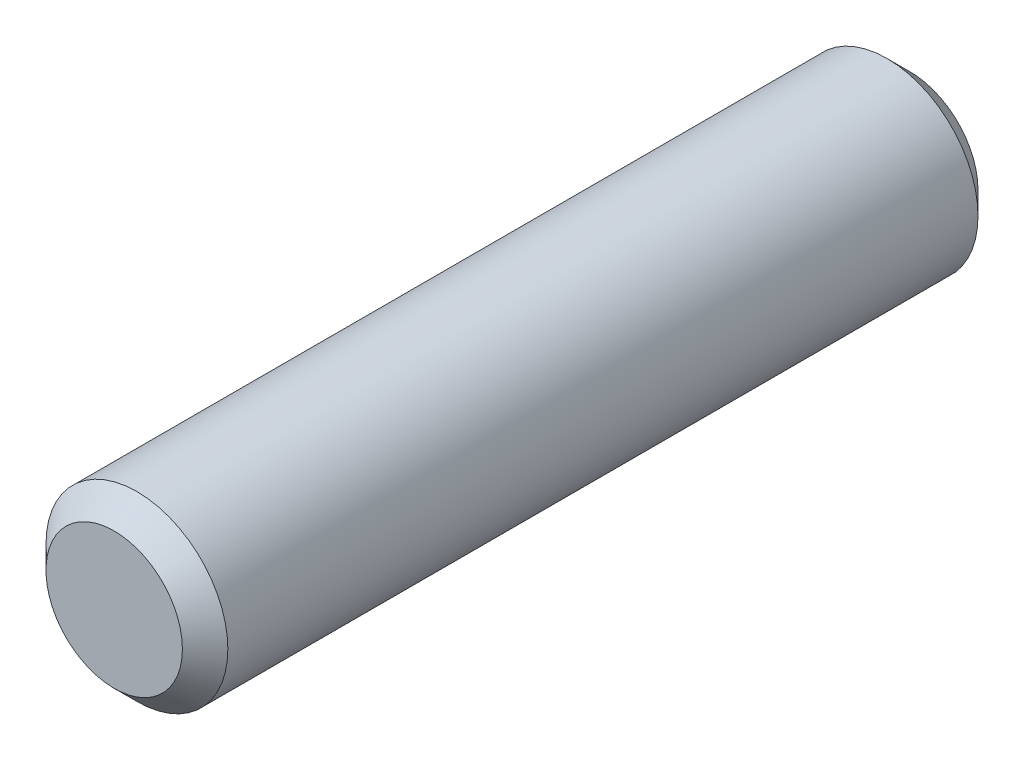
ISO-10303-21;
HEADER;
FILE_DESCRIPTION(('STEP AP214'),'2;1');
FILE_NAME('part.step','',(''),(''),'','','');
FILE_SCHEMA(('AUTOMOTIVE_DESIGN { 1 0 10303 214 1 1 1 1 }'));
ENDSEC;
DATA;
#1=APPLICATION_CONTEXT('core data for automotive mechanical design processes');
#2=APPLICATION_PROTOCOL_DEFINITION('international standard','automotive_design',2000,#1);
#3=PRODUCT_CONTEXT('',#1,'mechanical');
#4=PRODUCT('Part','Part','',(#3));
#5=PRODUCT_RELATED_PRODUCT_CATEGORY('part','',(#4));
#6=PRODUCT_DEFINITION_FORMATION('','',#4);
#7=PRODUCT_DEFINITION_CONTEXT('part definition',#1,'design');
#8=PRODUCT_DEFINITION('design','',#6,#7);
#9=PRODUCT_DEFINITION_SHAPE('','',#8);
#10=(LENGTH_UNIT() NAMED_UNIT(*) SI_UNIT(.MILLI.,.METRE.));
#11=(NAMED_UNIT(*) PLANE_ANGLE_UNIT() SI_UNIT($,.RADIAN.));
#12=(NAMED_UNIT(*) SI_UNIT($,.STERADIAN.) SOLID_ANGLE_UNIT());
#13=UNCERTAINTY_MEASURE_WITH_UNIT(LENGTH_MEASURE(1.E-05),#10,'distance_accuracy_value','');
#14=(GEOMETRIC_REPRESENTATION_CONTEXT(3) GLOBAL_UNCERTAINTY_ASSIGNED_CONTEXT((#13)) GLOBAL_UNIT_ASSIGNED_CONTEXT((#10,
#11,#12)) REPRESENTATION_CONTEXT('',''));
#15=CARTESIAN_POINT('',(0.,0.,0.));
#16=DIRECTION('',(0.,0.,1.));
#17=DIRECTION('',(1.,0.,0.));
#18=AXIS2_PLACEMENT_3D('',#15,#16,#17);
#19=CARTESIAN_POINT('',(0.,0.,35.));
#20=DIRECTION('',(0.,0.,-1.));
#21=DIRECTION('',(-1.,0.,0.));
#22=AXIS2_PLACEMENT_3D('',#19,#20,#21);
#23=CYLINDRICAL_SURFACE('',#22,4.);
#24=CARTESIAN_POINT('',(0.,0.,34.));
#25=DIRECTION('',(0.,0.,1.));
#26=DIRECTION('',(1.,0.,0.));
#27=AXIS2_PLACEMENT_3D('',#24,#25,#26);
#28=CIRCLE('',#27,4.);
#29=CARTESIAN_POINT('',(4.,0.,34.));
#30=VERTEX_POINT('',#29);
#31=EDGE_CURVE('E37',#30,#30,#28,.F.);
#32=ORIENTED_EDGE('',*,*,#31,.T.);
#33=EDGE_LOOP('',(#32));
#34=FACE_BOUND('',#33,.T.);
#35=CARTESIAN_POINT('',(0.,0.,1.00000000000001));
#36=DIRECTION('',(0.,0.,1.));
#37=DIRECTION('',(1.,0.,0.));
#38=AXIS2_PLACEMENT_3D('',#35,#36,#37);
#39=CIRCLE('',#38,4.);
#40=CARTESIAN_POINT('',(4.,0.,1.00000000000001));
#41=VERTEX_POINT('',#40);
#42=EDGE_CURVE('E41',#41,#41,#39,.T.);
#43=ORIENTED_EDGE('',*,*,#42,.T.);
#44=EDGE_LOOP('',(#43));
#45=FACE_BOUND('',#44,.T.);
#46=ADVANCED_FACE('F31',(#34,#45),#23,.T.);
#47=CARTESIAN_POINT('',(0.,0.,35.));
#48=DIRECTION('',(0.,0.,1.));
#49=DIRECTION('',(1.,0.,0.));
#50=AXIS2_PLACEMENT_3D('',#47,#48,#49);
#51=PLANE('',#50);
#52=CARTESIAN_POINT('',(0.,0.,35.));
#53=DIRECTION('',(0.,0.,1.));
#54=DIRECTION('',(1.,0.,0.));
#55=AXIS2_PLACEMENT_3D('',#52,#53,#54);
#56=CIRCLE('',#55,2.99999999999998);
#57=CARTESIAN_POINT('',(2.99999999999998,0.,35.));
#58=VERTEX_POINT('',#57);
#59=EDGE_CURVE('E45',#58,#58,#56,.T.);
#60=ORIENTED_EDGE('',*,*,#59,.T.);
#61=EDGE_LOOP('',(#60));
#62=FACE_BOUND('',#61,.T.);
#63=ADVANCED_FACE('F51',(#62),#51,.T.);
#64=CARTESIAN_POINT('',(0.,0.,0.));
#65=DIRECTION('',(0.,0.,1.));
#66=DIRECTION('',(1.,0.,0.));
#67=AXIS2_PLACEMENT_3D('',#64,#65,#66);
#68=PLANE('',#67);
#69=CARTESIAN_POINT('',(0.,0.,0.));
#70=DIRECTION('',(0.,0.,1.));
#71=DIRECTION('',(1.,0.,0.));
#72=AXIS2_PLACEMENT_3D('',#69,#70,#71);
#73=CIRCLE('',#72,2.99999999999999);
#74=CARTESIAN_POINT('',(2.99999999999999,0.,0.));
#75=VERTEX_POINT('',#74);
#76=EDGE_CURVE('E10',#75,#75,#73,.F.);
#77=ORIENTED_EDGE('',*,*,#76,.T.);
#78=EDGE_LOOP('',(#77));
#79=FACE_BOUND('',#78,.T.);
#80=ADVANCED_FACE('F56',(#79),#68,.F.);
#81=CARTESIAN_POINT('',(0.,0.,35.));
#82=DIRECTION('',(0.,0.,-1.));
#83=DIRECTION('',(-1.,0.,0.));
#84=AXIS2_PLACEMENT_3D('',#81,#82,#83);
#85=CONICAL_SURFACE('',#84,2.99999999999998,0.785398163397453);
#86=ORIENTED_EDGE('',*,*,#31,.F.);
#87=EDGE_LOOP('',(#86));
#88=FACE_BOUND('',#87,.T.);
#89=ORIENTED_EDGE('',*,*,#59,.F.);
#90=EDGE_LOOP('',(#89));
#91=FACE_BOUND('',#90,.T.);
#92=ADVANCED_FACE('F53',(#88,#91),#85,.T.);
#93=CARTESIAN_POINT('',(0.,0.,1.00000000000001));
#94=DIRECTION('',(0.,0.,1.));
#95=DIRECTION('',(1.,0.,0.));
#96=AXIS2_PLACEMENT_3D('',#93,#94,#95);
#97=CONICAL_SURFACE('',#96,4.,0.785398163397445);
#98=ORIENTED_EDGE('',*,*,#76,.F.);
#99=EDGE_LOOP('',(#98));
#100=FACE_BOUND('',#99,.T.);
#101=ORIENTED_EDGE('',*,*,#42,.F.);
#102=EDGE_LOOP('',(#101));
#103=FACE_BOUND('',#102,.T.);
#104=ADVANCED_FACE('F55',(#100,#103),#97,.T.);
#105=CLOSED_SHELL('',(#46,#63,#80,#92,#104));
#106=MANIFOLD_SOLID_BREP('B2',#105);
#107=ADVANCED_BREP_SHAPE_REPRESENTATION('',(#18,#106),#14);
#108=SHAPE_DEFINITION_REPRESENTATION(#9,#107);
ENDSEC;
END-ISO-10303-21;
